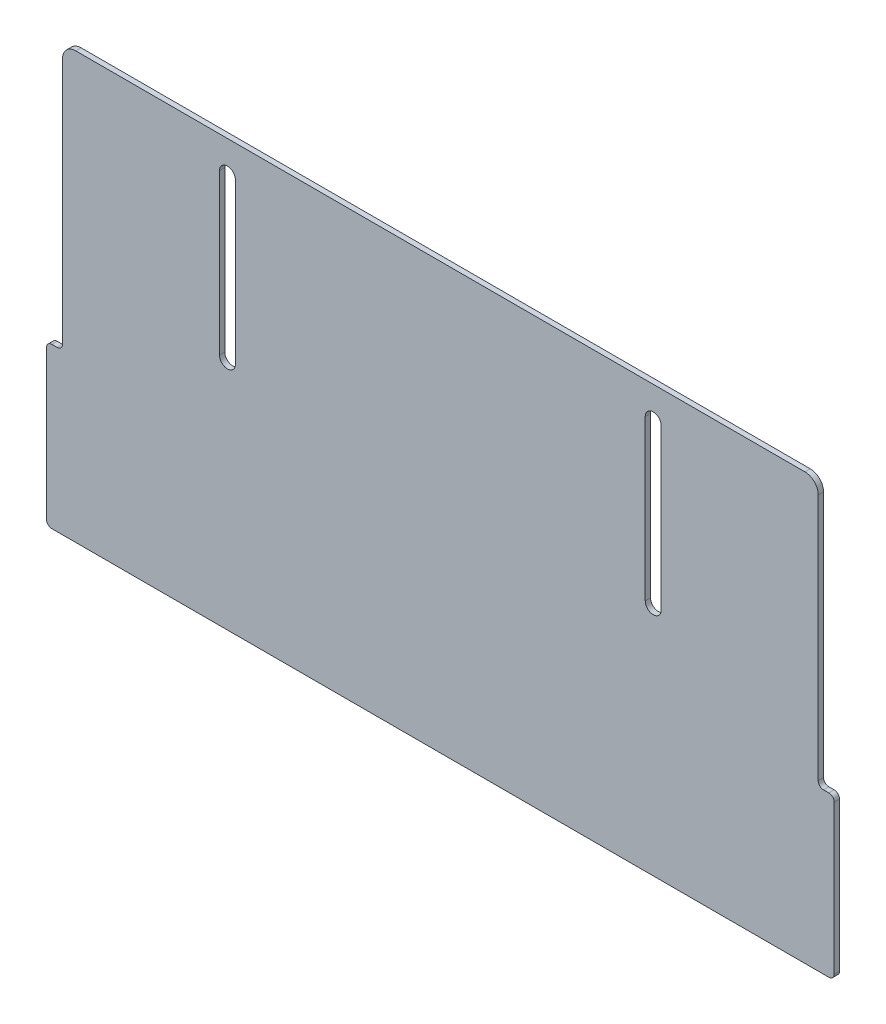
ISO-10303-21;
HEADER;
FILE_DESCRIPTION(('STEP AP214'),'2;1');
FILE_NAME('part.step','',(''),(''),'','','');
FILE_SCHEMA(('AUTOMOTIVE_DESIGN { 1 0 10303 214 1 1 1 1 }'));
ENDSEC;
DATA;
#1=APPLICATION_CONTEXT('core data for automotive mechanical design processes');
#2=APPLICATION_PROTOCOL_DEFINITION('international standard','automotive_design',2000,#1);
#3=PRODUCT_CONTEXT('',#1,'mechanical');
#4=PRODUCT('Part','Part','',(#3));
#5=PRODUCT_RELATED_PRODUCT_CATEGORY('part','',(#4));
#6=PRODUCT_DEFINITION_FORMATION('','',#4);
#7=PRODUCT_DEFINITION_CONTEXT('part definition',#1,'design');
#8=PRODUCT_DEFINITION('design','',#6,#7);
#9=PRODUCT_DEFINITION_SHAPE('','',#8);
#10=(LENGTH_UNIT() NAMED_UNIT(*) SI_UNIT(.MILLI.,.METRE.));
#11=(NAMED_UNIT(*) PLANE_ANGLE_UNIT() SI_UNIT($,.RADIAN.));
#12=(NAMED_UNIT(*) SI_UNIT($,.STERADIAN.) SOLID_ANGLE_UNIT());
#13=UNCERTAINTY_MEASURE_WITH_UNIT(LENGTH_MEASURE(1.E-05),#10,'distance_accuracy_value','');
#14=(GEOMETRIC_REPRESENTATION_CONTEXT(3) GLOBAL_UNCERTAINTY_ASSIGNED_CONTEXT((#13)) GLOBAL_UNIT_ASSIGNED_CONTEXT((#10,
#11,#12)) REPRESENTATION_CONTEXT('',''));
#15=CARTESIAN_POINT('',(0.,0.,0.));
#16=DIRECTION('',(0.,0.,1.));
#17=DIRECTION('',(1.,0.,0.));
#18=AXIS2_PLACEMENT_3D('',#15,#16,#17);
#19=CARTESIAN_POINT('',(77.,68.,0.));
#20=DIRECTION('',(1.,0.,0.));
#21=DIRECTION('',(0.,-1.,0.));
#22=AXIS2_PLACEMENT_3D('',#19,#20,#21);
#23=PLANE('',#22);
#24=DIRECTION('',(0.,0.,1.));
#25=VECTOR('',#24,1.);
#26=CARTESIAN_POINT('',(77.,8.00000000000003,0.));
#27=LINE('',#26,#25);
#28=CARTESIAN_POINT('',(77.,8.00000000000003,-2.));
#29=VERTEX_POINT('',#28);
#30=CARTESIAN_POINT('',(77.,8.00000000000003,0.));
#31=VERTEX_POINT('',#30);
#32=EDGE_CURVE('E11',#29,#31,#27,.T.);
#33=ORIENTED_EDGE('',*,*,#32,.F.);
#34=DIRECTION('',(0.,1.,0.));
#35=VECTOR('',#34,1.);
#36=CARTESIAN_POINT('',(77.,0.,-2.));
#37=LINE('',#36,#35);
#38=CARTESIAN_POINT('',(77.,68.,-2.));
#39=VERTEX_POINT('',#38);
#40=EDGE_CURVE('E152',#39,#29,#37,.F.);
#41=ORIENTED_EDGE('',*,*,#40,.F.);
#42=DIRECTION('',(0.,0.,1.));
#43=VECTOR('',#42,1.);
#44=CARTESIAN_POINT('',(77.,68.,0.));
#45=LINE('',#44,#43);
#46=CARTESIAN_POINT('',(77.,68.,0.));
#47=VERTEX_POINT('',#46);
#48=EDGE_CURVE('E47',#39,#47,#45,.T.);
#49=ORIENTED_EDGE('',*,*,#48,.T.);
#50=DIRECTION('',(0.,-1.,0.));
#51=VECTOR('',#50,1.);
#52=CARTESIAN_POINT('',(77.,68.,0.));
#53=LINE('',#52,#51);
#54=EDGE_CURVE('E230',#47,#31,#53,.T.);
#55=ORIENTED_EDGE('',*,*,#54,.T.);
#56=EDGE_LOOP('',(#33,#41,#49,#55));
#57=FACE_BOUND('',#56,.T.);
#58=ADVANCED_FACE('F37',(#57),#23,.T.);
#59=CARTESIAN_POINT('',(80.,68.,0.));
#60=DIRECTION('',(0.,0.,-1.));
#61=DIRECTION('',(-1.,0.,0.));
#62=AXIS2_PLACEMENT_3D('',#59,#60,#61);
#63=CYLINDRICAL_SURFACE('',#62,3.);
#64=ORIENTED_EDGE('',*,*,#48,.F.);
#65=CARTESIAN_POINT('',(80.,68.,-2.));
#66=DIRECTION('',(0.,0.,1.));
#67=DIRECTION('',(1.,0.,0.));
#68=AXIS2_PLACEMENT_3D('',#65,#66,#67);
#69=CIRCLE('',#68,3.);
#70=CARTESIAN_POINT('',(83.,68.,-2.));
#71=VERTEX_POINT('',#70);
#72=EDGE_CURVE('E164',#71,#39,#69,.T.);
#73=ORIENTED_EDGE('',*,*,#72,.F.);
#74=DIRECTION('',(0.,0.,1.));
#75=VECTOR('',#74,1.);
#76=CARTESIAN_POINT('',(83.,68.,0.));
#77=LINE('',#76,#75);
#78=CARTESIAN_POINT('',(83.,68.,0.));
#79=VERTEX_POINT('',#78);
#80=EDGE_CURVE('E55',#71,#79,#77,.T.);
#81=ORIENTED_EDGE('',*,*,#80,.T.);
#82=CARTESIAN_POINT('',(80.,68.,0.));
#83=DIRECTION('',(0.,0.,1.));
#84=DIRECTION('',(-1.,0.,0.));
#85=AXIS2_PLACEMENT_3D('',#82,#83,#84);
#86=CIRCLE('',#85,3.);
#87=EDGE_CURVE('E217',#79,#47,#86,.T.);
#88=ORIENTED_EDGE('',*,*,#87,.T.);
#89=EDGE_LOOP('',(#64,#73,#81,#88));
#90=FACE_BOUND('',#89,.T.);
#91=ADVANCED_FACE('F235',(#90),#63,.F.);
#92=CARTESIAN_POINT('',(83.,68.,0.));
#93=DIRECTION('',(-1.,0.,0.));
#94=DIRECTION('',(0.,1.,0.));
#95=AXIS2_PLACEMENT_3D('',#92,#93,#94);
#96=PLANE('',#95);
#97=ORIENTED_EDGE('',*,*,#80,.F.);
#98=DIRECTION('',(0.,1.,0.));
#99=VECTOR('',#98,1.);
#100=CARTESIAN_POINT('',(83.,0.,-2.));
#101=LINE('',#100,#99);
#102=CARTESIAN_POINT('',(83.,8.00000000000003,-2.));
#103=VERTEX_POINT('',#102);
#104=EDGE_CURVE('E151',#103,#71,#101,.T.);
#105=ORIENTED_EDGE('',*,*,#104,.F.);
#106=DIRECTION('',(0.,0.,1.));
#107=VECTOR('',#106,1.);
#108=CARTESIAN_POINT('',(83.,8.00000000000003,0.));
#109=LINE('',#108,#107);
#110=CARTESIAN_POINT('',(83.,8.00000000000003,0.));
#111=VERTEX_POINT('',#110);
#112=EDGE_CURVE('E41',#103,#111,#109,.T.);
#113=ORIENTED_EDGE('',*,*,#112,.T.);
#114=DIRECTION('',(0.,1.,0.));
#115=VECTOR('',#114,1.);
#116=CARTESIAN_POINT('',(83.,68.,0.));
#117=LINE('',#116,#115);
#118=EDGE_CURVE('E415',#111,#79,#117,.T.);
#119=ORIENTED_EDGE('',*,*,#118,.T.);
#120=EDGE_LOOP('',(#97,#105,#113,#119));
#121=FACE_BOUND('',#120,.T.);
#122=ADVANCED_FACE('F154',(#121),#96,.T.);
#123=CARTESIAN_POINT('',(-77.,68.,0.));
#124=DIRECTION('',(-1.,0.,0.));
#125=DIRECTION('',(0.,1.,0.));
#126=AXIS2_PLACEMENT_3D('',#123,#124,#125);
#127=PLANE('',#126);
#128=DIRECTION('',(0.,0.,1.));
#129=VECTOR('',#128,1.);
#130=CARTESIAN_POINT('',(-77.,68.,0.));
#131=LINE('',#130,#129);
#132=CARTESIAN_POINT('',(-77.,68.,-2.));
#133=VERTEX_POINT('',#132);
#134=CARTESIAN_POINT('',(-77.,68.,0.));
#135=VERTEX_POINT('',#134);
#136=EDGE_CURVE('E146',#133,#135,#131,.T.);
#137=ORIENTED_EDGE('',*,*,#136,.F.);
#138=DIRECTION('',(0.,1.,0.));
#139=VECTOR('',#138,1.);
#140=CARTESIAN_POINT('',(-77.,0.,-2.));
#141=LINE('',#140,#139);
#142=CARTESIAN_POINT('',(-77.,8.00000000000001,-2.));
#143=VERTEX_POINT('',#142);
#144=EDGE_CURVE('E158',#143,#133,#141,.T.);
#145=ORIENTED_EDGE('',*,*,#144,.F.);
#146=DIRECTION('',(0.,0.,1.));
#147=VECTOR('',#146,1.);
#148=CARTESIAN_POINT('',(-77.,8.00000000000001,0.));
#149=LINE('',#148,#147);
#150=CARTESIAN_POINT('',(-77.,8.00000000000001,0.));
#151=VERTEX_POINT('',#150);
#152=EDGE_CURVE('E221',#143,#151,#149,.T.);
#153=ORIENTED_EDGE('',*,*,#152,.T.);
#154=DIRECTION('',(0.,1.,0.));
#155=VECTOR('',#154,1.);
#156=CARTESIAN_POINT('',(-77.,68.,0.));
#157=LINE('',#156,#155);
#158=EDGE_CURVE('E411',#151,#135,#157,.T.);
#159=ORIENTED_EDGE('',*,*,#158,.T.);
#160=EDGE_LOOP('',(#137,#145,#153,#159));
#161=FACE_BOUND('',#160,.T.);
#162=ADVANCED_FACE('F418',(#161),#127,.T.);
#163=CARTESIAN_POINT('',(-80.,8.00000000000001,0.));
#164=DIRECTION('',(0.,0.,-1.));
#165=DIRECTION('',(-1.,0.,0.));
#166=AXIS2_PLACEMENT_3D('',#163,#164,#165);
#167=CYLINDRICAL_SURFACE('',#166,3.);
#168=ORIENTED_EDGE('',*,*,#152,.F.);
#169=CARTESIAN_POINT('',(-80.,8.00000000000001,-2.));
#170=DIRECTION('',(0.,0.,1.));
#171=DIRECTION('',(1.,0.,0.));
#172=AXIS2_PLACEMENT_3D('',#169,#170,#171);
#173=CIRCLE('',#172,3.);
#174=CARTESIAN_POINT('',(-83.,8.00000000000001,-2.));
#175=VERTEX_POINT('',#174);
#176=EDGE_CURVE('E155',#175,#143,#173,.T.);
#177=ORIENTED_EDGE('',*,*,#176,.F.);
#178=DIRECTION('',(0.,0.,1.));
#179=VECTOR('',#178,1.);
#180=CARTESIAN_POINT('',(-83.,8.00000000000001,0.));
#181=LINE('',#180,#179);
#182=CARTESIAN_POINT('',(-83.,8.00000000000001,0.));
#183=VERTEX_POINT('',#182);
#184=EDGE_CURVE('E218',#175,#183,#181,.T.);
#185=ORIENTED_EDGE('',*,*,#184,.T.);
#186=CARTESIAN_POINT('',(-80.,8.00000000000001,0.));
#187=DIRECTION('',(0.,0.,1.));
#188=DIRECTION('',(1.,0.,0.));
#189=AXIS2_PLACEMENT_3D('',#186,#187,#188);
#190=CIRCLE('',#189,3.);
#191=EDGE_CURVE('E309',#183,#151,#190,.T.);
#192=ORIENTED_EDGE('',*,*,#191,.T.);
#193=EDGE_LOOP('',(#168,#177,#185,#192));
#194=FACE_BOUND('',#193,.T.);
#195=ADVANCED_FACE('F307',(#194),#167,.F.);
#196=CARTESIAN_POINT('',(-83.,68.,0.));
#197=DIRECTION('',(1.,0.,0.));
#198=DIRECTION('',(0.,-1.,0.));
#199=AXIS2_PLACEMENT_3D('',#196,#197,#198);
#200=PLANE('',#199);
#201=ORIENTED_EDGE('',*,*,#184,.F.);
#202=DIRECTION('',(0.,1.,0.));
#203=VECTOR('',#202,1.);
#204=CARTESIAN_POINT('',(-83.,0.,-2.));
#205=LINE('',#204,#203);
#206=CARTESIAN_POINT('',(-83.,68.,-2.));
#207=VERTEX_POINT('',#206);
#208=EDGE_CURVE('E246',#207,#175,#205,.F.);
#209=ORIENTED_EDGE('',*,*,#208,.F.);
#210=DIRECTION('',(0.,0.,1.));
#211=VECTOR('',#210,1.);
#212=CARTESIAN_POINT('',(-83.,68.,0.));
#213=LINE('',#212,#211);
#214=CARTESIAN_POINT('',(-83.,68.,0.));
#215=VERTEX_POINT('',#214);
#216=EDGE_CURVE('E214',#207,#215,#213,.T.);
#217=ORIENTED_EDGE('',*,*,#216,.T.);
#218=DIRECTION('',(0.,-1.,0.));
#219=VECTOR('',#218,1.);
#220=CARTESIAN_POINT('',(-83.,68.,0.));
#221=LINE('',#220,#219);
#222=EDGE_CURVE('E303',#215,#183,#221,.T.);
#223=ORIENTED_EDGE('',*,*,#222,.T.);
#224=EDGE_LOOP('',(#201,#209,#217,#223));
#225=FACE_BOUND('',#224,.T.);
#226=ADVANCED_FACE('F298',(#225),#200,.T.);
#227=CARTESIAN_POINT('',(-142.,-80.,0.));
#228=DIRECTION('',(0.,1.,0.));
#229=DIRECTION('',(1.,0.,0.));
#230=AXIS2_PLACEMENT_3D('',#227,#228,#229);
#231=PLANE('',#230);
#232=DIRECTION('',(0.,0.,1.));
#233=VECTOR('',#232,1.);
#234=CARTESIAN_POINT('',(-146.,-80.,0.));
#235=LINE('',#234,#233);
#236=CARTESIAN_POINT('',(-146.,-80.,-2.));
#237=VERTEX_POINT('',#236);
#238=CARTESIAN_POINT('',(-146.,-80.,0.));
#239=VERTEX_POINT('',#238);
#240=EDGE_CURVE('E211',#237,#239,#235,.T.);
#241=ORIENTED_EDGE('',*,*,#240,.F.);
#242=DIRECTION('',(-1.,0.,0.));
#243=VECTOR('',#242,1.);
#244=CARTESIAN_POINT('',(0.,-80.,-2.));
#245=LINE('',#244,#243);
#246=CARTESIAN_POINT('',(146.,-80.,-2.));
#247=VERTEX_POINT('',#246);
#248=EDGE_CURVE('E283',#237,#247,#245,.F.);
#249=ORIENTED_EDGE('',*,*,#248,.T.);
#250=DIRECTION('',(0.,0.,1.));
#251=VECTOR('',#250,1.);
#252=CARTESIAN_POINT('',(146.,-80.,0.));
#253=LINE('',#252,#251);
#254=CARTESIAN_POINT('',(146.,-80.,0.));
#255=VERTEX_POINT('',#254);
#256=EDGE_CURVE('E208',#247,#255,#253,.T.);
#257=ORIENTED_EDGE('',*,*,#256,.T.);
#258=DIRECTION('',(1.,0.,0.));
#259=VECTOR('',#258,1.);
#260=CARTESIAN_POINT('',(-142.,-80.,0.));
#261=LINE('',#260,#259);
#262=EDGE_CURVE('E367',#239,#255,#261,.T.);
#263=ORIENTED_EDGE('',*,*,#262,.F.);
#264=EDGE_LOOP('',(#241,#249,#257,#263));
#265=FACE_BOUND('',#264,.T.);
#266=ADVANCED_FACE('F445',(#265),#231,.F.);
#267=CARTESIAN_POINT('',(146.,-78.,0.));
#268=DIRECTION('',(0.,0.,-1.));
#269=DIRECTION('',(-1.,0.,0.));
#270=AXIS2_PLACEMENT_3D('',#267,#268,#269);
#271=CYLINDRICAL_SURFACE('',#270,2.);
#272=ORIENTED_EDGE('',*,*,#256,.F.);
#273=CARTESIAN_POINT('',(146.,-78.,-2.));
#274=DIRECTION('',(0.,0.,-1.));
#275=DIRECTION('',(-1.,0.,0.));
#276=AXIS2_PLACEMENT_3D('',#273,#274,#275);
#277=CIRCLE('',#276,2.);
#278=CARTESIAN_POINT('',(148.,-78.,-2.));
#279=VERTEX_POINT('',#278);
#280=EDGE_CURVE('E280',#247,#279,#277,.F.);
#281=ORIENTED_EDGE('',*,*,#280,.T.);
#282=DIRECTION('',(0.,0.,1.));
#283=VECTOR('',#282,1.);
#284=CARTESIAN_POINT('',(148.,-78.,0.));
#285=LINE('',#284,#283);
#286=CARTESIAN_POINT('',(148.,-78.,0.));
#287=VERTEX_POINT('',#286);
#288=EDGE_CURVE('E205',#279,#287,#285,.T.);
#289=ORIENTED_EDGE('',*,*,#288,.T.);
#290=CARTESIAN_POINT('',(146.,-78.,0.));
#291=DIRECTION('',(0.,0.,-1.));
#292=DIRECTION('',(-1.,0.,0.));
#293=AXIS2_PLACEMENT_3D('',#290,#291,#292);
#294=CIRCLE('',#293,2.);
#295=EDGE_CURVE('E369',#255,#287,#294,.F.);
#296=ORIENTED_EDGE('',*,*,#295,.F.);
#297=EDGE_LOOP('',(#272,#281,#289,#296));
#298=FACE_BOUND('',#297,.T.);
#299=ADVANCED_FACE('F449',(#298),#271,.T.);
#300=CARTESIAN_POINT('',(148.,-20.,0.));
#301=DIRECTION('',(-1.,0.,0.));
#302=DIRECTION('',(0.,1.,0.));
#303=AXIS2_PLACEMENT_3D('',#300,#301,#302);
#304=PLANE('',#303);
#305=ORIENTED_EDGE('',*,*,#288,.F.);
#306=DIRECTION('',(0.,1.,0.));
#307=VECTOR('',#306,1.);
#308=CARTESIAN_POINT('',(148.,0.,-2.));
#309=LINE('',#308,#307);
#310=CARTESIAN_POINT('',(148.,-22.,-2.));
#311=VERTEX_POINT('',#310);
#312=EDGE_CURVE('E277',#279,#311,#309,.T.);
#313=ORIENTED_EDGE('',*,*,#312,.T.);
#314=DIRECTION('',(0.,0.,1.));
#315=VECTOR('',#314,1.);
#316=CARTESIAN_POINT('',(148.,-22.,0.));
#317=LINE('',#316,#315);
#318=CARTESIAN_POINT('',(148.,-22.,0.));
#319=VERTEX_POINT('',#318);
#320=EDGE_CURVE('E202',#311,#319,#317,.T.);
#321=ORIENTED_EDGE('',*,*,#320,.T.);
#322=DIRECTION('',(0.,1.,0.));
#323=VECTOR('',#322,1.);
#324=CARTESIAN_POINT('',(148.,-20.,0.));
#325=LINE('',#324,#323);
#326=EDGE_CURVE('E374',#287,#319,#325,.T.);
#327=ORIENTED_EDGE('',*,*,#326,.F.);
#328=EDGE_LOOP('',(#305,#313,#321,#327));
#329=FACE_BOUND('',#328,.T.);
#330=ADVANCED_FACE('F453',(#329),#304,.F.);
#331=CARTESIAN_POINT('',(146.,-22.,0.));
#332=DIRECTION('',(0.,0.,-1.));
#333=DIRECTION('',(-1.,0.,0.));
#334=AXIS2_PLACEMENT_3D('',#331,#332,#333);
#335=CYLINDRICAL_SURFACE('',#334,2.);
#336=ORIENTED_EDGE('',*,*,#320,.F.);
#337=CARTESIAN_POINT('',(146.,-22.,-2.));
#338=DIRECTION('',(0.,0.,-1.));
#339=DIRECTION('',(-1.,0.,0.));
#340=AXIS2_PLACEMENT_3D('',#337,#338,#339);
#341=CIRCLE('',#340,2.);
#342=CARTESIAN_POINT('',(146.,-20.,-2.));
#343=VERTEX_POINT('',#342);
#344=EDGE_CURVE('E274',#311,#343,#341,.F.);
#345=ORIENTED_EDGE('',*,*,#344,.T.);
#346=DIRECTION('',(0.,0.,1.));
#347=VECTOR('',#346,1.);
#348=CARTESIAN_POINT('',(146.,-20.,0.));
#349=LINE('',#348,#347);
#350=CARTESIAN_POINT('',(146.,-20.,0.));
#351=VERTEX_POINT('',#350);
#352=EDGE_CURVE('E199',#343,#351,#349,.T.);
#353=ORIENTED_EDGE('',*,*,#352,.T.);
#354=CARTESIAN_POINT('',(146.,-22.,0.));
#355=DIRECTION('',(0.,0.,-1.));
#356=DIRECTION('',(-1.,0.,0.));
#357=AXIS2_PLACEMENT_3D('',#354,#355,#356);
#358=CIRCLE('',#357,2.);
#359=EDGE_CURVE('E377',#319,#351,#358,.F.);
#360=ORIENTED_EDGE('',*,*,#359,.F.);
#361=EDGE_LOOP('',(#336,#345,#353,#360));
#362=FACE_BOUND('',#361,.T.);
#363=ADVANCED_FACE('F457',(#362),#335,.T.);
#364=CARTESIAN_POINT('',(142.,-20.,0.));
#365=DIRECTION('',(0.,-1.,0.));
#366=DIRECTION('',(-1.,0.,0.));
#367=AXIS2_PLACEMENT_3D('',#364,#365,#366);
#368=PLANE('',#367);
#369=ORIENTED_EDGE('',*,*,#352,.F.);
#370=DIRECTION('',(-1.,0.,0.));
#371=VECTOR('',#370,1.);
#372=CARTESIAN_POINT('',(0.,-20.,-2.));
#373=LINE('',#372,#371);
#374=CARTESIAN_POINT('',(144.,-20.,-2.));
#375=VERTEX_POINT('',#374);
#376=EDGE_CURVE('E271',#343,#375,#373,.T.);
#377=ORIENTED_EDGE('',*,*,#376,.T.);
#378=DIRECTION('',(0.,0.,1.));
#379=VECTOR('',#378,1.);
#380=CARTESIAN_POINT('',(144.,-20.,0.));
#381=LINE('',#380,#379);
#382=CARTESIAN_POINT('',(144.,-20.,0.));
#383=VERTEX_POINT('',#382);
#384=EDGE_CURVE('E196',#375,#383,#381,.T.);
#385=ORIENTED_EDGE('',*,*,#384,.T.);
#386=DIRECTION('',(-1.,0.,0.));
#387=VECTOR('',#386,1.);
#388=CARTESIAN_POINT('',(142.,-20.,0.));
#389=LINE('',#388,#387);
#390=EDGE_CURVE('E380',#351,#383,#389,.T.);
#391=ORIENTED_EDGE('',*,*,#390,.F.);
#392=EDGE_LOOP('',(#369,#377,#385,#391));
#393=FACE_BOUND('',#392,.T.);
#394=ADVANCED_FACE('F461',(#393),#368,.F.);
#395=CARTESIAN_POINT('',(144.,-18.,0.));
#396=DIRECTION('',(0.,0.,-1.));
#397=DIRECTION('',(-1.,0.,0.));
#398=AXIS2_PLACEMENT_3D('',#395,#396,#397);
#399=CYLINDRICAL_SURFACE('',#398,2.);
#400=ORIENTED_EDGE('',*,*,#384,.F.);
#401=CARTESIAN_POINT('',(144.,-18.,-2.));
#402=DIRECTION('',(0.,0.,-1.));
#403=DIRECTION('',(-1.,0.,0.));
#404=AXIS2_PLACEMENT_3D('',#401,#402,#403);
#405=CIRCLE('',#404,2.);
#406=CARTESIAN_POINT('',(142.,-18.,-2.));
#407=VERTEX_POINT('',#406);
#408=EDGE_CURVE('E268',#375,#407,#405,.T.);
#409=ORIENTED_EDGE('',*,*,#408,.T.);
#410=DIRECTION('',(0.,0.,1.));
#411=VECTOR('',#410,1.);
#412=CARTESIAN_POINT('',(142.,-18.,0.));
#413=LINE('',#412,#411);
#414=CARTESIAN_POINT('',(142.,-18.,0.));
#415=VERTEX_POINT('',#414);
#416=EDGE_CURVE('E193',#407,#415,#413,.T.);
#417=ORIENTED_EDGE('',*,*,#416,.T.);
#418=CARTESIAN_POINT('',(144.,-18.,0.));
#419=DIRECTION('',(0.,0.,-1.));
#420=DIRECTION('',(-1.,0.,0.));
#421=AXIS2_PLACEMENT_3D('',#418,#419,#420);
#422=CIRCLE('',#421,2.);
#423=EDGE_CURVE('E383',#383,#415,#422,.T.);
#424=ORIENTED_EDGE('',*,*,#423,.F.);
#425=EDGE_LOOP('',(#400,#409,#417,#424));
#426=FACE_BOUND('',#425,.T.);
#427=ADVANCED_FACE('F465',(#426),#399,.F.);
#428=CARTESIAN_POINT('',(142.,-80.,0.));
#429=DIRECTION('',(-1.,0.,0.));
#430=DIRECTION('',(0.,1.,0.));
#431=AXIS2_PLACEMENT_3D('',#428,#429,#430);
#432=PLANE('',#431);
#433=ORIENTED_EDGE('',*,*,#416,.F.);
#434=DIRECTION('',(0.,1.,0.));
#435=VECTOR('',#434,1.);
#436=CARTESIAN_POINT('',(142.,0.,-2.));
#437=LINE('',#436,#435);
#438=CARTESIAN_POINT('',(142.,75.,-2.));
#439=VERTEX_POINT('',#438);
#440=EDGE_CURVE('E265',#407,#439,#437,.T.);
#441=ORIENTED_EDGE('',*,*,#440,.T.);
#442=DIRECTION('',(0.,0.,1.));
#443=VECTOR('',#442,1.);
#444=CARTESIAN_POINT('',(142.,75.,0.));
#445=LINE('',#444,#443);
#446=CARTESIAN_POINT('',(142.,75.,0.));
#447=VERTEX_POINT('',#446);
#448=EDGE_CURVE('E190',#439,#447,#445,.T.);
#449=ORIENTED_EDGE('',*,*,#448,.T.);
#450=DIRECTION('',(0.,1.,0.));
#451=VECTOR('',#450,1.);
#452=CARTESIAN_POINT('',(142.,-80.,0.));
#453=LINE('',#452,#451);
#454=EDGE_CURVE('E386',#415,#447,#453,.T.);
#455=ORIENTED_EDGE('',*,*,#454,.F.);
#456=EDGE_LOOP('',(#433,#441,#449,#455));
#457=FACE_BOUND('',#456,.T.);
#458=ADVANCED_FACE('F469',(#457),#432,.F.);
#459=CARTESIAN_POINT('',(137.,75.,0.));
#460=DIRECTION('',(0.,0.,-1.));
#461=DIRECTION('',(-1.,0.,0.));
#462=AXIS2_PLACEMENT_3D('',#459,#460,#461);
#463=CYLINDRICAL_SURFACE('',#462,5.);
#464=ORIENTED_EDGE('',*,*,#448,.F.);
#465=CARTESIAN_POINT('',(137.,75.,-2.));
#466=DIRECTION('',(0.,0.,-1.));
#467=DIRECTION('',(-1.,0.,0.));
#468=AXIS2_PLACEMENT_3D('',#465,#466,#467);
#469=CIRCLE('',#468,5.);
#470=CARTESIAN_POINT('',(137.,80.,-2.));
#471=VERTEX_POINT('',#470);
#472=EDGE_CURVE('E262',#439,#471,#469,.F.);
#473=ORIENTED_EDGE('',*,*,#472,.T.);
#474=DIRECTION('',(0.,0.,1.));
#475=VECTOR('',#474,1.);
#476=CARTESIAN_POINT('',(137.,80.,0.));
#477=LINE('',#476,#475);
#478=CARTESIAN_POINT('',(137.,80.,0.));
#479=VERTEX_POINT('',#478);
#480=EDGE_CURVE('E187',#471,#479,#477,.T.);
#481=ORIENTED_EDGE('',*,*,#480,.T.);
#482=CARTESIAN_POINT('',(137.,75.,0.));
#483=DIRECTION('',(0.,0.,-1.));
#484=DIRECTION('',(-1.,0.,0.));
#485=AXIS2_PLACEMENT_3D('',#482,#483,#484);
#486=CIRCLE('',#485,5.);
#487=EDGE_CURVE('E389',#447,#479,#486,.F.);
#488=ORIENTED_EDGE('',*,*,#487,.F.);
#489=EDGE_LOOP('',(#464,#473,#481,#488));
#490=FACE_BOUND('',#489,.T.);
#491=ADVANCED_FACE('F473',(#490),#463,.T.);
#492=CARTESIAN_POINT('',(-142.,80.,0.));
#493=DIRECTION('',(0.,-1.,0.));
#494=DIRECTION('',(-1.,0.,0.));
#495=AXIS2_PLACEMENT_3D('',#492,#493,#494);
#496=PLANE('',#495);
#497=ORIENTED_EDGE('',*,*,#480,.F.);
#498=DIRECTION('',(-1.,0.,0.));
#499=VECTOR('',#498,1.);
#500=CARTESIAN_POINT('',(0.,80.,-2.));
#501=LINE('',#500,#499);
#502=CARTESIAN_POINT('',(-137.,80.,-2.));
#503=VERTEX_POINT('',#502);
#504=EDGE_CURVE('E259',#471,#503,#501,.T.);
#505=ORIENTED_EDGE('',*,*,#504,.T.);
#506=DIRECTION('',(0.,0.,1.));
#507=VECTOR('',#506,1.);
#508=CARTESIAN_POINT('',(-137.,80.,0.));
#509=LINE('',#508,#507);
#510=CARTESIAN_POINT('',(-137.,80.,0.));
#511=VERTEX_POINT('',#510);
#512=EDGE_CURVE('E184',#503,#511,#509,.T.);
#513=ORIENTED_EDGE('',*,*,#512,.T.);
#514=DIRECTION('',(-1.,0.,0.));
#515=VECTOR('',#514,1.);
#516=CARTESIAN_POINT('',(-142.,80.,0.));
#517=LINE('',#516,#515);
#518=EDGE_CURVE('E392',#479,#511,#517,.T.);
#519=ORIENTED_EDGE('',*,*,#518,.F.);
#520=EDGE_LOOP('',(#497,#505,#513,#519));
#521=FACE_BOUND('',#520,.T.);
#522=ADVANCED_FACE('F477',(#521),#496,.F.);
#523=CARTESIAN_POINT('',(-137.,75.,0.));
#524=DIRECTION('',(0.,0.,-1.));
#525=DIRECTION('',(-1.,0.,0.));
#526=AXIS2_PLACEMENT_3D('',#523,#524,#525);
#527=CYLINDRICAL_SURFACE('',#526,5.);
#528=ORIENTED_EDGE('',*,*,#512,.F.);
#529=CARTESIAN_POINT('',(-137.,75.,-2.));
#530=DIRECTION('',(0.,0.,-1.));
#531=DIRECTION('',(-1.,0.,0.));
#532=AXIS2_PLACEMENT_3D('',#529,#530,#531);
#533=CIRCLE('',#532,5.);
#534=CARTESIAN_POINT('',(-142.,75.,-2.));
#535=VERTEX_POINT('',#534);
#536=EDGE_CURVE('E256',#503,#535,#533,.F.);
#537=ORIENTED_EDGE('',*,*,#536,.T.);
#538=DIRECTION('',(0.,0.,1.));
#539=VECTOR('',#538,1.);
#540=CARTESIAN_POINT('',(-142.,75.,0.));
#541=LINE('',#540,#539);
#542=CARTESIAN_POINT('',(-142.,75.,0.));
#543=VERTEX_POINT('',#542);
#544=EDGE_CURVE('E181',#535,#543,#541,.T.);
#545=ORIENTED_EDGE('',*,*,#544,.T.);
#546=CARTESIAN_POINT('',(-137.,75.,0.));
#547=DIRECTION('',(0.,0.,-1.));
#548=DIRECTION('',(-1.,0.,0.));
#549=AXIS2_PLACEMENT_3D('',#546,#547,#548);
#550=CIRCLE('',#549,5.);
#551=EDGE_CURVE('E395',#511,#543,#550,.F.);
#552=ORIENTED_EDGE('',*,*,#551,.F.);
#553=EDGE_LOOP('',(#528,#537,#545,#552));
#554=FACE_BOUND('',#553,.T.);
#555=ADVANCED_FACE('F481',(#554),#527,.T.);
#556=CARTESIAN_POINT('',(-142.,-80.,0.));
#557=DIRECTION('',(1.,0.,0.));
#558=DIRECTION('',(0.,-1.,0.));
#559=AXIS2_PLACEMENT_3D('',#556,#557,#558);
#560=PLANE('',#559);
#561=ORIENTED_EDGE('',*,*,#544,.F.);
#562=DIRECTION('',(0.,1.,0.));
#563=VECTOR('',#562,1.);
#564=CARTESIAN_POINT('',(-142.,0.,-2.));
#565=LINE('',#564,#563);
#566=CARTESIAN_POINT('',(-142.,-18.,-2.));
#567=VERTEX_POINT('',#566);
#568=EDGE_CURVE('E253',#535,#567,#565,.F.);
#569=ORIENTED_EDGE('',*,*,#568,.T.);
#570=DIRECTION('',(0.,0.,1.));
#571=VECTOR('',#570,1.);
#572=CARTESIAN_POINT('',(-142.,-18.,0.));
#573=LINE('',#572,#571);
#574=CARTESIAN_POINT('',(-142.,-18.,0.));
#575=VERTEX_POINT('',#574);
#576=EDGE_CURVE('E178',#567,#575,#573,.T.);
#577=ORIENTED_EDGE('',*,*,#576,.T.);
#578=DIRECTION('',(0.,-1.,0.));
#579=VECTOR('',#578,1.);
#580=CARTESIAN_POINT('',(-142.,-80.,0.));
#581=LINE('',#580,#579);
#582=EDGE_CURVE('E398',#543,#575,#581,.T.);
#583=ORIENTED_EDGE('',*,*,#582,.F.);
#584=EDGE_LOOP('',(#561,#569,#577,#583));
#585=FACE_BOUND('',#584,.T.);
#586=ADVANCED_FACE('F485',(#585),#560,.F.);
#587=CARTESIAN_POINT('',(-144.,-18.,0.));
#588=DIRECTION('',(0.,0.,-1.));
#589=DIRECTION('',(-1.,0.,0.));
#590=AXIS2_PLACEMENT_3D('',#587,#588,#589);
#591=CYLINDRICAL_SURFACE('',#590,2.);
#592=ORIENTED_EDGE('',*,*,#576,.F.);
#593=CARTESIAN_POINT('',(-144.,-18.,-2.));
#594=DIRECTION('',(0.,0.,-1.));
#595=DIRECTION('',(-1.,0.,0.));
#596=AXIS2_PLACEMENT_3D('',#593,#594,#595);
#597=CIRCLE('',#596,2.);
#598=CARTESIAN_POINT('',(-144.,-20.,-2.));
#599=VERTEX_POINT('',#598);
#600=EDGE_CURVE('E250',#567,#599,#597,.T.);
#601=ORIENTED_EDGE('',*,*,#600,.T.);
#602=DIRECTION('',(0.,0.,1.));
#603=VECTOR('',#602,1.);
#604=CARTESIAN_POINT('',(-144.,-20.,0.));
#605=LINE('',#604,#603);
#606=CARTESIAN_POINT('',(-144.,-20.,0.));
#607=VERTEX_POINT('',#606);
#608=EDGE_CURVE('E175',#599,#607,#605,.T.);
#609=ORIENTED_EDGE('',*,*,#608,.T.);
#610=CARTESIAN_POINT('',(-144.,-18.,0.));
#611=DIRECTION('',(0.,0.,-1.));
#612=DIRECTION('',(-1.,0.,0.));
#613=AXIS2_PLACEMENT_3D('',#610,#611,#612);
#614=CIRCLE('',#613,2.);
#615=EDGE_CURVE('E401',#575,#607,#614,.T.);
#616=ORIENTED_EDGE('',*,*,#615,.F.);
#617=EDGE_LOOP('',(#592,#601,#609,#616));
#618=FACE_BOUND('',#617,.T.);
#619=ADVANCED_FACE('F489',(#618),#591,.F.);
#620=CARTESIAN_POINT('',(-142.,-20.,0.));
#621=DIRECTION('',(0.,-1.,0.));
#622=DIRECTION('',(-1.,0.,0.));
#623=AXIS2_PLACEMENT_3D('',#620,#621,#622);
#624=PLANE('',#623);
#625=ORIENTED_EDGE('',*,*,#608,.F.);
#626=DIRECTION('',(-1.,0.,0.));
#627=VECTOR('',#626,1.);
#628=CARTESIAN_POINT('',(0.,-20.,-2.));
#629=LINE('',#628,#627);
#630=CARTESIAN_POINT('',(-146.,-20.,-2.));
#631=VERTEX_POINT('',#630);
#632=EDGE_CURVE('E247',#599,#631,#629,.T.);
#633=ORIENTED_EDGE('',*,*,#632,.T.);
#634=DIRECTION('',(0.,0.,1.));
#635=VECTOR('',#634,1.);
#636=CARTESIAN_POINT('',(-146.,-20.,0.));
#637=LINE('',#636,#635);
#638=CARTESIAN_POINT('',(-146.,-20.,0.));
#639=VERTEX_POINT('',#638);
#640=EDGE_CURVE('E171',#631,#639,#637,.T.);
#641=ORIENTED_EDGE('',*,*,#640,.T.);
#642=DIRECTION('',(-1.,0.,0.));
#643=VECTOR('',#642,1.);
#644=CARTESIAN_POINT('',(-142.,-20.,0.));
#645=LINE('',#644,#643);
#646=EDGE_CURVE('E404',#607,#639,#645,.T.);
#647=ORIENTED_EDGE('',*,*,#646,.F.);
#648=EDGE_LOOP('',(#625,#633,#641,#647));
#649=FACE_BOUND('',#648,.T.);
#650=ADVANCED_FACE('F493',(#649),#624,.F.);
#651=CARTESIAN_POINT('',(-146.,-22.,0.));
#652=DIRECTION('',(0.,0.,-1.));
#653=DIRECTION('',(-1.,0.,0.));
#654=AXIS2_PLACEMENT_3D('',#651,#652,#653);
#655=CYLINDRICAL_SURFACE('',#654,2.);
#656=ORIENTED_EDGE('',*,*,#640,.F.);
#657=CARTESIAN_POINT('',(-146.,-22.,-2.));
#658=DIRECTION('',(0.,0.,-1.));
#659=DIRECTION('',(-1.,0.,0.));
#660=AXIS2_PLACEMENT_3D('',#657,#658,#659);
#661=CIRCLE('',#660,2.);
#662=CARTESIAN_POINT('',(-148.,-22.,-2.));
#663=VERTEX_POINT('',#662);
#664=EDGE_CURVE('E243',#631,#663,#661,.F.);
#665=ORIENTED_EDGE('',*,*,#664,.T.);
#666=DIRECTION('',(0.,0.,1.));
#667=VECTOR('',#666,1.);
#668=CARTESIAN_POINT('',(-148.,-22.,0.));
#669=LINE('',#668,#667);
#670=CARTESIAN_POINT('',(-148.,-22.,0.));
#671=VERTEX_POINT('',#670);
#672=EDGE_CURVE('E168',#663,#671,#669,.T.);
#673=ORIENTED_EDGE('',*,*,#672,.T.);
#674=CARTESIAN_POINT('',(-146.,-22.,0.));
#675=DIRECTION('',(0.,0.,-1.));
#676=DIRECTION('',(-1.,0.,0.));
#677=AXIS2_PLACEMENT_3D('',#674,#675,#676);
#678=CIRCLE('',#677,2.);
#679=EDGE_CURVE('E364',#639,#671,#678,.F.);
#680=ORIENTED_EDGE('',*,*,#679,.F.);
#681=EDGE_LOOP('',(#656,#665,#673,#680));
#682=FACE_BOUND('',#681,.T.);
#683=ADVANCED_FACE('F497',(#682),#655,.T.);
#684=CARTESIAN_POINT('',(-148.,-20.,0.));
#685=DIRECTION('',(1.,0.,0.));
#686=DIRECTION('',(0.,-1.,0.));
#687=AXIS2_PLACEMENT_3D('',#684,#685,#686);
#688=PLANE('',#687);
#689=ORIENTED_EDGE('',*,*,#672,.F.);
#690=DIRECTION('',(0.,1.,0.));
#691=VECTOR('',#690,1.);
#692=CARTESIAN_POINT('',(-148.,0.,-2.));
#693=LINE('',#692,#691);
#694=CARTESIAN_POINT('',(-148.,-78.,-2.));
#695=VERTEX_POINT('',#694);
#696=EDGE_CURVE('E239',#663,#695,#693,.F.);
#697=ORIENTED_EDGE('',*,*,#696,.T.);
#698=DIRECTION('',(0.,0.,1.));
#699=VECTOR('',#698,1.);
#700=CARTESIAN_POINT('',(-148.,-78.,0.));
#701=LINE('',#700,#699);
#702=CARTESIAN_POINT('',(-148.,-78.,0.));
#703=VERTEX_POINT('',#702);
#704=EDGE_CURVE('E172',#695,#703,#701,.T.);
#705=ORIENTED_EDGE('',*,*,#704,.T.);
#706=DIRECTION('',(0.,-1.,0.));
#707=VECTOR('',#706,1.);
#708=CARTESIAN_POINT('',(-148.,-20.,0.));
#709=LINE('',#708,#707);
#710=EDGE_CURVE('E166',#671,#703,#709,.T.);
#711=ORIENTED_EDGE('',*,*,#710,.F.);
#712=EDGE_LOOP('',(#689,#697,#705,#711));
#713=FACE_BOUND('',#712,.T.);
#714=ADVANCED_FACE('F350',(#713),#688,.F.);
#715=CARTESIAN_POINT('',(-146.,-78.,0.));
#716=DIRECTION('',(0.,0.,-1.));
#717=DIRECTION('',(-1.,0.,0.));
#718=AXIS2_PLACEMENT_3D('',#715,#716,#717);
#719=CYLINDRICAL_SURFACE('',#718,2.);
#720=CARTESIAN_POINT('',(-146.,-78.,-2.));
#721=DIRECTION('',(0.,0.,-1.));
#722=DIRECTION('',(-1.,0.,0.));
#723=AXIS2_PLACEMENT_3D('',#720,#721,#722);
#724=CIRCLE('',#723,2.);
#725=EDGE_CURVE('E242',#695,#237,#724,.F.);
#726=ORIENTED_EDGE('',*,*,#725,.T.);
#727=ORIENTED_EDGE('',*,*,#240,.T.);
#728=CARTESIAN_POINT('',(-146.,-78.,0.));
#729=DIRECTION('',(0.,0.,-1.));
#730=DIRECTION('',(-1.,0.,0.));
#731=AXIS2_PLACEMENT_3D('',#728,#729,#730);
#732=CIRCLE('',#731,2.);
#733=EDGE_CURVE('E360',#703,#239,#732,.F.);
#734=ORIENTED_EDGE('',*,*,#733,.F.);
#735=ORIENTED_EDGE('',*,*,#704,.F.);
#736=EDGE_LOOP('',(#726,#727,#734,#735));
#737=FACE_BOUND('',#736,.T.);
#738=ADVANCED_FACE('F366',(#737),#719,.T.);
#739=CARTESIAN_POINT('',(-80.,68.,0.));
#740=DIRECTION('',(0.,0.,-1.));
#741=DIRECTION('',(-1.,0.,0.));
#742=AXIS2_PLACEMENT_3D('',#739,#740,#741);
#743=CYLINDRICAL_SURFACE('',#742,3.);
#744=CARTESIAN_POINT('',(-80.,68.,-2.));
#745=DIRECTION('',(0.,0.,1.));
#746=DIRECTION('',(1.,0.,0.));
#747=AXIS2_PLACEMENT_3D('',#744,#745,#746);
#748=CIRCLE('',#747,3.);
#749=EDGE_CURVE('E162',#133,#207,#748,.T.);
#750=ORIENTED_EDGE('',*,*,#749,.F.);
#751=ORIENTED_EDGE('',*,*,#136,.T.);
#752=CARTESIAN_POINT('',(-80.,68.,0.));
#753=DIRECTION('',(0.,0.,1.));
#754=DIRECTION('',(1.,0.,0.));
#755=AXIS2_PLACEMENT_3D('',#752,#753,#754);
#756=CIRCLE('',#755,3.);
#757=EDGE_CURVE('E408',#135,#215,#756,.T.);
#758=ORIENTED_EDGE('',*,*,#757,.T.);
#759=ORIENTED_EDGE('',*,*,#216,.F.);
#760=EDGE_LOOP('',(#750,#751,#758,#759));
#761=FACE_BOUND('',#760,.T.);
#762=ADVANCED_FACE('F420',(#761),#743,.F.);
#763=CARTESIAN_POINT('',(80.,8.00000000000003,0.));
#764=DIRECTION('',(0.,0.,-1.));
#765=DIRECTION('',(-1.,0.,0.));
#766=AXIS2_PLACEMENT_3D('',#763,#764,#765);
#767=CYLINDRICAL_SURFACE('',#766,3.);
#768=CARTESIAN_POINT('',(80.,8.00000000000003,-2.));
#769=DIRECTION('',(0.,0.,1.));
#770=DIRECTION('',(1.,0.,0.));
#771=AXIS2_PLACEMENT_3D('',#768,#769,#770);
#772=CIRCLE('',#771,3.);
#773=EDGE_CURVE('E139',#29,#103,#772,.T.);
#774=ORIENTED_EDGE('',*,*,#773,.F.);
#775=ORIENTED_EDGE('',*,*,#32,.T.);
#776=CARTESIAN_POINT('',(80.,8.00000000000003,0.));
#777=DIRECTION('',(0.,0.,1.));
#778=DIRECTION('',(-1.,0.,0.));
#779=AXIS2_PLACEMENT_3D('',#776,#777,#778);
#780=CIRCLE('',#779,3.);
#781=EDGE_CURVE('E142',#31,#111,#780,.T.);
#782=ORIENTED_EDGE('',*,*,#781,.T.);
#783=ORIENTED_EDGE('',*,*,#112,.F.);
#784=EDGE_LOOP('',(#774,#775,#782,#783));
#785=FACE_BOUND('',#784,.T.);
#786=ADVANCED_FACE('F39',(#785),#767,.F.);
#787=CARTESIAN_POINT('',(0.,0.,0.));
#788=DIRECTION('',(0.,0.,-1.));
#789=DIRECTION('',(-1.,0.,0.));
#790=AXIS2_PLACEMENT_3D('',#787,#788,#789);
#791=PLANE('',#790);
#792=ORIENTED_EDGE('',*,*,#710,.T.);
#793=ORIENTED_EDGE('',*,*,#733,.T.);
#794=ORIENTED_EDGE('',*,*,#262,.T.);
#795=ORIENTED_EDGE('',*,*,#295,.T.);
#796=ORIENTED_EDGE('',*,*,#326,.T.);
#797=ORIENTED_EDGE('',*,*,#359,.T.);
#798=ORIENTED_EDGE('',*,*,#390,.T.);
#799=ORIENTED_EDGE('',*,*,#423,.T.);
#800=ORIENTED_EDGE('',*,*,#454,.T.);
#801=ORIENTED_EDGE('',*,*,#487,.T.);
#802=ORIENTED_EDGE('',*,*,#518,.T.);
#803=ORIENTED_EDGE('',*,*,#551,.T.);
#804=ORIENTED_EDGE('',*,*,#582,.T.);
#805=ORIENTED_EDGE('',*,*,#615,.T.);
#806=ORIENTED_EDGE('',*,*,#646,.T.);
#807=ORIENTED_EDGE('',*,*,#679,.T.);
#808=EDGE_LOOP('',(#792,#793,#794,#795,#796,#797,#798,#799,#800,#801,#802,#803,#804,#805,#806,#807));
#809=FACE_BOUND('',#808,.T.);
#810=ORIENTED_EDGE('',*,*,#222,.F.);
#811=ORIENTED_EDGE('',*,*,#757,.F.);
#812=ORIENTED_EDGE('',*,*,#158,.F.);
#813=ORIENTED_EDGE('',*,*,#191,.F.);
#814=EDGE_LOOP('',(#810,#811,#812,#813));
#815=FACE_BOUND('',#814,.T.);
#816=ORIENTED_EDGE('',*,*,#118,.F.);
#817=ORIENTED_EDGE('',*,*,#781,.F.);
#818=ORIENTED_EDGE('',*,*,#54,.F.);
#819=ORIENTED_EDGE('',*,*,#87,.F.);
#820=EDGE_LOOP('',(#816,#817,#818,#819));
#821=FACE_BOUND('',#820,.T.);
#822=ADVANCED_FACE('F233',(#809,#815,#821),#791,.F.);
#823=CARTESIAN_POINT('',(0.,0.,-2.));
#824=DIRECTION('',(0.,0.,-1.));
#825=DIRECTION('',(-1.,0.,0.));
#826=AXIS2_PLACEMENT_3D('',#823,#824,#825);
#827=PLANE('',#826);
#828=ORIENTED_EDGE('',*,*,#696,.F.);
#829=ORIENTED_EDGE('',*,*,#664,.F.);
#830=ORIENTED_EDGE('',*,*,#632,.F.);
#831=ORIENTED_EDGE('',*,*,#600,.F.);
#832=ORIENTED_EDGE('',*,*,#568,.F.);
#833=ORIENTED_EDGE('',*,*,#536,.F.);
#834=ORIENTED_EDGE('',*,*,#504,.F.);
#835=ORIENTED_EDGE('',*,*,#472,.F.);
#836=ORIENTED_EDGE('',*,*,#440,.F.);
#837=ORIENTED_EDGE('',*,*,#408,.F.);
#838=ORIENTED_EDGE('',*,*,#376,.F.);
#839=ORIENTED_EDGE('',*,*,#344,.F.);
#840=ORIENTED_EDGE('',*,*,#312,.F.);
#841=ORIENTED_EDGE('',*,*,#280,.F.);
#842=ORIENTED_EDGE('',*,*,#248,.F.);
#843=ORIENTED_EDGE('',*,*,#725,.F.);
#844=EDGE_LOOP('',(#828,#829,#830,#831,#832,#833,#834,#835,#836,#837,#838,#839,#840,#841,#842,#843));
#845=FACE_BOUND('',#844,.T.);
#846=ORIENTED_EDGE('',*,*,#208,.T.);
#847=ORIENTED_EDGE('',*,*,#176,.T.);
#848=ORIENTED_EDGE('',*,*,#144,.T.);
#849=ORIENTED_EDGE('',*,*,#749,.T.);
#850=EDGE_LOOP('',(#846,#847,#848,#849));
#851=FACE_BOUND('',#850,.T.);
#852=ORIENTED_EDGE('',*,*,#104,.T.);
#853=ORIENTED_EDGE('',*,*,#72,.T.);
#854=ORIENTED_EDGE('',*,*,#40,.T.);
#855=ORIENTED_EDGE('',*,*,#773,.T.);
#856=EDGE_LOOP('',(#852,#853,#854,#855));
#857=FACE_BOUND('',#856,.T.);
#858=ADVANCED_FACE('F149',(#845,#851,#857),#827,.T.);
#859=CLOSED_SHELL('',(#58,#91,#122,#162,#195,#226,#266,#299,#330,#363,#394,#427,#458,#491,#522,
#555,#586,#619,#650,#683,#714,#738,#762,#786,#822,#858));
#860=MANIFOLD_SOLID_BREP('B2',#859);
#861=ADVANCED_BREP_SHAPE_REPRESENTATION('',(#18,#860),#14);
#862=SHAPE_DEFINITION_REPRESENTATION(#9,#861);
ENDSEC;
END-ISO-10303-21;
